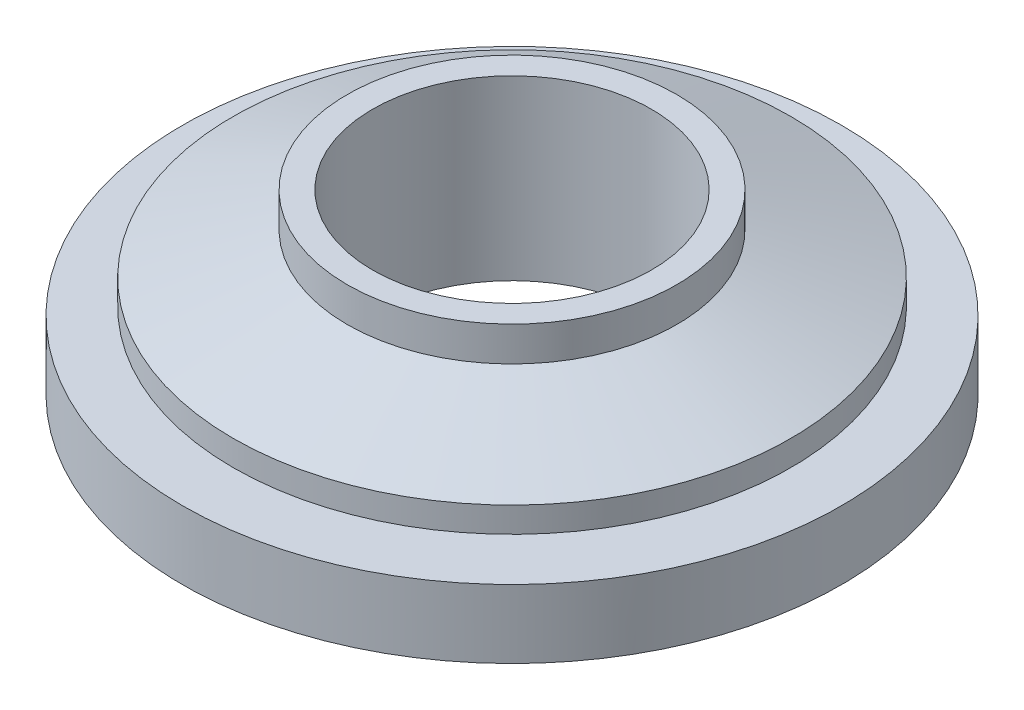
ISO-10303-21;
HEADER;
FILE_DESCRIPTION(('STEP AP214'),'2;1');
FILE_NAME('part.step','',(''),(''),'','','');
FILE_SCHEMA(('AUTOMOTIVE_DESIGN { 1 0 10303 214 1 1 1 1 }'));
ENDSEC;
DATA;
#1=APPLICATION_CONTEXT('core data for automotive mechanical design processes');
#2=APPLICATION_PROTOCOL_DEFINITION('international standard','automotive_design',2000,#1);
#3=PRODUCT_CONTEXT('',#1,'mechanical');
#4=PRODUCT('Part','Part','',(#3));
#5=PRODUCT_RELATED_PRODUCT_CATEGORY('part','',(#4));
#6=PRODUCT_DEFINITION_FORMATION('','',#4);
#7=PRODUCT_DEFINITION_CONTEXT('part definition',#1,'design');
#8=PRODUCT_DEFINITION('design','',#6,#7);
#9=PRODUCT_DEFINITION_SHAPE('','',#8);
#10=(LENGTH_UNIT() NAMED_UNIT(*) SI_UNIT(.MILLI.,.METRE.));
#11=(NAMED_UNIT(*) PLANE_ANGLE_UNIT() SI_UNIT($,.RADIAN.));
#12=(NAMED_UNIT(*) SI_UNIT($,.STERADIAN.) SOLID_ANGLE_UNIT());
#13=UNCERTAINTY_MEASURE_WITH_UNIT(LENGTH_MEASURE(1.E-05),#10,'distance_accuracy_value','');
#14=(GEOMETRIC_REPRESENTATION_CONTEXT(3) GLOBAL_UNCERTAINTY_ASSIGNED_CONTEXT((#13)) GLOBAL_UNIT_ASSIGNED_CONTEXT((#10,
#11,#12)) REPRESENTATION_CONTEXT('',''));
#15=CARTESIAN_POINT('',(0.,0.,0.));
#16=DIRECTION('',(0.,0.,1.));
#17=DIRECTION('',(1.,0.,0.));
#18=AXIS2_PLACEMENT_3D('',#15,#16,#17);
#19=CARTESIAN_POINT('',(0.,39.7695526217005,0.));
#20=DIRECTION('',(0.,-1.,0.));
#21=DIRECTION('',(0.,0.,-1.));
#22=AXIS2_PLACEMENT_3D('',#19,#20,#21);
#23=CYLINDRICAL_SURFACE('',#22,13.);
#24=CARTESIAN_POINT('',(0.,0.,0.));
#25=DIRECTION('',(0.,-1.,0.));
#26=DIRECTION('',(0.,0.,-1.));
#27=AXIS2_PLACEMENT_3D('',#24,#25,#26);
#28=CIRCLE('',#27,13.);
#29=CARTESIAN_POINT('',(0.,0.,-13.));
#30=VERTEX_POINT('',#29);
#31=EDGE_CURVE('E52',#30,#30,#28,.T.);
#32=ORIENTED_EDGE('',*,*,#31,.F.);
#33=EDGE_LOOP('',(#32));
#34=FACE_BOUND('',#33,.T.);
#35=CARTESIAN_POINT('',(0.,2.7,0.));
#36=DIRECTION('',(0.,1.,0.));
#37=DIRECTION('',(0.,0.,1.));
#38=AXIS2_PLACEMENT_3D('',#35,#36,#37);
#39=CIRCLE('',#38,13.);
#40=CARTESIAN_POINT('',(0.,2.7,13.));
#41=VERTEX_POINT('',#40);
#42=EDGE_CURVE('E48',#41,#41,#39,.F.);
#43=ORIENTED_EDGE('',*,*,#42,.T.);
#44=EDGE_LOOP('',(#43));
#45=FACE_BOUND('',#44,.T.);
#46=ADVANCED_FACE('F44',(#34,#45),#23,.T.);
#47=CARTESIAN_POINT('',(0.,39.7695526217005,0.));
#48=DIRECTION('',(0.,-1.,0.));
#49=DIRECTION('',(0.,0.,-1.));
#50=AXIS2_PLACEMENT_3D('',#47,#48,#49);
#51=CYLINDRICAL_SURFACE('',#50,8.6);
#52=CARTESIAN_POINT('',(0.,0.,0.));
#53=DIRECTION('',(0.,-1.,0.));
#54=DIRECTION('',(0.,0.,-1.));
#55=AXIS2_PLACEMENT_3D('',#52,#53,#54);
#56=CIRCLE('',#55,8.6);
#57=CARTESIAN_POINT('',(0.,0.,-8.6));
#58=VERTEX_POINT('',#57);
#59=EDGE_CURVE('E56',#58,#58,#56,.T.);
#60=ORIENTED_EDGE('',*,*,#59,.T.);
#61=EDGE_LOOP('',(#60));
#62=FACE_BOUND('',#61,.T.);
#63=CARTESIAN_POINT('',(0.,2.7,0.));
#64=DIRECTION('',(0.,1.,0.));
#65=DIRECTION('',(0.,0.,1.));
#66=AXIS2_PLACEMENT_3D('',#63,#64,#65);
#67=CIRCLE('',#66,8.6);
#68=CARTESIAN_POINT('',(0.,2.7,8.6));
#69=VERTEX_POINT('',#68);
#70=EDGE_CURVE('E12',#69,#69,#67,.F.);
#71=ORIENTED_EDGE('',*,*,#70,.F.);
#72=EDGE_LOOP('',(#71));
#73=FACE_BOUND('',#72,.T.);
#74=ADVANCED_FACE('F71',(#62,#73),#51,.F.);
#75=CARTESIAN_POINT('',(0.,0.,0.));
#76=DIRECTION('',(0.,-1.,0.));
#77=DIRECTION('',(0.,0.,-1.));
#78=AXIS2_PLACEMENT_3D('',#75,#76,#77);
#79=PLANE('',#78);
#80=ORIENTED_EDGE('',*,*,#59,.F.);
#81=EDGE_LOOP('',(#80));
#82=FACE_BOUND('',#81,.T.);
#83=ORIENTED_EDGE('',*,*,#31,.T.);
#84=EDGE_LOOP('',(#83));
#85=FACE_BOUND('',#84,.T.);
#86=ADVANCED_FACE('F67',(#82,#85),#79,.T.);
#87=CARTESIAN_POINT('',(0.,2.7,0.));
#88=DIRECTION('',(0.,1.,0.));
#89=DIRECTION('',(0.,0.,1.));
#90=AXIS2_PLACEMENT_3D('',#87,#88,#89);
#91=PLANE('',#90);
#92=ORIENTED_EDGE('',*,*,#42,.F.);
#93=EDGE_LOOP('',(#92));
#94=FACE_BOUND('',#93,.T.);
#95=ORIENTED_EDGE('',*,*,#70,.T.);
#96=EDGE_LOOP('',(#95));
#97=FACE_BOUND('',#96,.T.);
#98=ADVANCED_FACE('F46',(#94,#97),#91,.T.);
#99=CLOSED_SHELL('',(#46,#74,#86,#98));
#100=MANIFOLD_SOLID_BREP('B2',#99);
#101=CARTESIAN_POINT('',(0.,7.,0.));
#102=DIRECTION('',(0.,1.,0.));
#103=DIRECTION('',(0.,0.,1.));
#104=AXIS2_PLACEMENT_3D('',#101,#102,#103);
#105=PLANE('',#104);
#106=CARTESIAN_POINT('',(0.,7.,0.));
#107=DIRECTION('',(0.,1.,0.));
#108=DIRECTION('',(0.,0.,1.));
#109=AXIS2_PLACEMENT_3D('',#106,#107,#108);
#110=CIRCLE('',#109,5.5);
#111=CARTESIAN_POINT('',(0.,7.,5.5));
#112=VERTEX_POINT('',#111);
#113=EDGE_CURVE('E135',#112,#112,#110,.T.);
#114=ORIENTED_EDGE('',*,*,#113,.F.);
#115=EDGE_LOOP('',(#114));
#116=FACE_BOUND('',#115,.T.);
#117=CARTESIAN_POINT('',(0.,7.,0.));
#118=DIRECTION('',(0.,1.,0.));
#119=DIRECTION('',(0.,0.,1.));
#120=AXIS2_PLACEMENT_3D('',#117,#118,#119);
#121=CIRCLE('',#120,6.5);
#122=CARTESIAN_POINT('',(0.,7.,6.5));
#123=VERTEX_POINT('',#122);
#124=EDGE_CURVE('E138',#123,#123,#121,.T.);
#125=ORIENTED_EDGE('',*,*,#124,.T.);
#126=EDGE_LOOP('',(#125));
#127=FACE_BOUND('',#126,.T.);
#128=ADVANCED_FACE('F106',(#116,#127),#105,.T.);
#129=CARTESIAN_POINT('',(0.,7.,0.));
#130=DIRECTION('',(0.,-1.,0.));
#131=DIRECTION('',(0.,0.,-1.));
#132=AXIS2_PLACEMENT_3D('',#129,#130,#131);
#133=CYLINDRICAL_SURFACE('',#132,11.);
#134=CARTESIAN_POINT('',(0.,3.99999999999996,0.));
#135=DIRECTION('',(0.,1.,0.));
#136=DIRECTION('',(0.,0.,1.));
#137=AXIS2_PLACEMENT_3D('',#134,#135,#136);
#138=CIRCLE('',#137,11.);
#139=CARTESIAN_POINT('',(0.,3.99999999999996,11.));
#140=VERTEX_POINT('',#139);
#141=EDGE_CURVE('E113',#140,#140,#138,.F.);
#142=ORIENTED_EDGE('',*,*,#141,.T.);
#143=EDGE_LOOP('',(#142));
#144=FACE_BOUND('',#143,.T.);
#145=CARTESIAN_POINT('',(0.,3.,0.));
#146=DIRECTION('',(0.,1.,0.));
#147=DIRECTION('',(0.,0.,1.));
#148=AXIS2_PLACEMENT_3D('',#145,#146,#147);
#149=CIRCLE('',#148,11.);
#150=CARTESIAN_POINT('',(0.,3.,11.));
#151=VERTEX_POINT('',#150);
#152=EDGE_CURVE('E132',#151,#151,#149,.T.);
#153=ORIENTED_EDGE('',*,*,#152,.T.);
#154=EDGE_LOOP('',(#153));
#155=FACE_BOUND('',#154,.T.);
#156=ADVANCED_FACE('F157',(#144,#155),#133,.T.);
#157=CARTESIAN_POINT('',(0.,0.,0.));
#158=DIRECTION('',(0.,1.,0.));
#159=DIRECTION('',(0.,0.,1.));
#160=AXIS2_PLACEMENT_3D('',#157,#158,#159);
#161=PLANE('',#160);
#162=CARTESIAN_POINT('',(0.,0.,0.));
#163=DIRECTION('',(0.,1.,0.));
#164=DIRECTION('',(0.,0.,1.));
#165=AXIS2_PLACEMENT_3D('',#162,#163,#164);
#166=CIRCLE('',#165,6.6);
#167=CARTESIAN_POINT('',(0.,0.,6.6));
#168=VERTEX_POINT('',#167);
#169=EDGE_CURVE('E117',#168,#168,#166,.F.);
#170=ORIENTED_EDGE('',*,*,#169,.T.);
#171=EDGE_LOOP('',(#170));
#172=FACE_BOUND('',#171,.T.);
#173=CARTESIAN_POINT('',(0.,0.,0.));
#174=DIRECTION('',(0.,1.,0.));
#175=DIRECTION('',(0.,0.,1.));
#176=AXIS2_PLACEMENT_3D('',#173,#174,#175);
#177=CIRCLE('',#176,5.5);
#178=CARTESIAN_POINT('',(0.,0.,5.5));
#179=VERTEX_POINT('',#178);
#180=EDGE_CURVE('E129',#179,#179,#177,.T.);
#181=ORIENTED_EDGE('',*,*,#180,.T.);
#182=EDGE_LOOP('',(#181));
#183=FACE_BOUND('',#182,.T.);
#184=ADVANCED_FACE('F162',(#172,#183),#161,.F.);
#185=CARTESIAN_POINT('',(0.,3.,0.));
#186=DIRECTION('',(0.,-1.,0.));
#187=DIRECTION('',(0.,0.,-1.));
#188=AXIS2_PLACEMENT_3D('',#185,#186,#187);
#189=CYLINDRICAL_SURFACE('',#188,7.);
#190=CARTESIAN_POINT('',(0.,1.09899096778184,0.));
#191=DIRECTION('',(0.,1.,0.));
#192=DIRECTION('',(0.,0.,1.));
#193=AXIS2_PLACEMENT_3D('',#190,#191,#192);
#194=CIRCLE('',#193,7.);
#195=CARTESIAN_POINT('',(0.,1.09899096778184,7.));
#196=VERTEX_POINT('',#195);
#197=EDGE_CURVE('E121',#196,#196,#194,.T.);
#198=ORIENTED_EDGE('',*,*,#197,.T.);
#199=EDGE_LOOP('',(#198));
#200=FACE_BOUND('',#199,.T.);
#201=CARTESIAN_POINT('',(0.,3.,0.));
#202=DIRECTION('',(0.,1.,0.));
#203=DIRECTION('',(0.,0.,1.));
#204=AXIS2_PLACEMENT_3D('',#201,#202,#203);
#205=CIRCLE('',#204,7.);
#206=CARTESIAN_POINT('',(0.,3.,7.));
#207=VERTEX_POINT('',#206);
#208=EDGE_CURVE('E126',#207,#207,#205,.T.);
#209=ORIENTED_EDGE('',*,*,#208,.F.);
#210=EDGE_LOOP('',(#209));
#211=FACE_BOUND('',#210,.T.);
#212=ADVANCED_FACE('F169',(#200,#211),#189,.T.);
#213=CARTESIAN_POINT('',(0.,3.,0.));
#214=DIRECTION('',(0.,-1.,0.));
#215=DIRECTION('',(0.,0.,-1.));
#216=AXIS2_PLACEMENT_3D('',#213,#214,#215);
#217=CYLINDRICAL_SURFACE('',#216,5.5);
#218=ORIENTED_EDGE('',*,*,#180,.F.);
#219=EDGE_LOOP('',(#218));
#220=FACE_BOUND('',#219,.T.);
#221=ORIENTED_EDGE('',*,*,#113,.T.);
#222=EDGE_LOOP('',(#221));
#223=FACE_BOUND('',#222,.T.);
#224=ADVANCED_FACE('F166',(#220,#223),#217,.F.);
#225=CARTESIAN_POINT('',(0.,1.09899096778184,0.));
#226=DIRECTION('',(0.,1.,0.));
#227=DIRECTION('',(0.,0.,1.));
#228=AXIS2_PLACEMENT_3D('',#225,#226,#227);
#229=CONICAL_SURFACE('',#228,7.,0.349065850398867);
#230=ORIENTED_EDGE('',*,*,#169,.F.);
#231=EDGE_LOOP('',(#230));
#232=FACE_BOUND('',#231,.T.);
#233=ORIENTED_EDGE('',*,*,#197,.F.);
#234=EDGE_LOOP('',(#233));
#235=FACE_BOUND('',#234,.T.);
#236=ADVANCED_FACE('F152',(#232,#235),#229,.T.);
#237=CARTESIAN_POINT('',(0.,3.,0.));
#238=DIRECTION('',(0.,1.,0.));
#239=DIRECTION('',(0.,0.,1.));
#240=AXIS2_PLACEMENT_3D('',#237,#238,#239);
#241=PLANE('',#240);
#242=ORIENTED_EDGE('',*,*,#152,.F.);
#243=EDGE_LOOP('',(#242));
#244=FACE_BOUND('',#243,.T.);
#245=ORIENTED_EDGE('',*,*,#208,.T.);
#246=EDGE_LOOP('',(#245));
#247=FACE_BOUND('',#246,.T.);
#248=ADVANCED_FACE('F145',(#244,#247),#241,.F.);
#249=CARTESIAN_POINT('',(0.,6.,0.));
#250=DIRECTION('',(0.,1.,0.));
#251=DIRECTION('',(0.,0.,1.));
#252=AXIS2_PLACEMENT_3D('',#249,#250,#251);
#253=CYLINDRICAL_SURFACE('',#252,6.5);
#254=CARTESIAN_POINT('',(0.,5.63786605419785,0.));
#255=DIRECTION('',(0.,-1.,0.));
#256=DIRECTION('',(0.,0.,-1.));
#257=AXIS2_PLACEMENT_3D('',#254,#255,#256);
#258=CIRCLE('',#257,6.5);
#259=CARTESIAN_POINT('',(0.,5.63786605419785,-6.5));
#260=VERTEX_POINT('',#259);
#261=EDGE_CURVE('E43',#260,#260,#258,.F.);
#262=ORIENTED_EDGE('',*,*,#261,.T.);
#263=EDGE_LOOP('',(#262));
#264=FACE_BOUND('',#263,.T.);
#265=ORIENTED_EDGE('',*,*,#124,.F.);
#266=EDGE_LOOP('',(#265));
#267=FACE_BOUND('',#266,.T.);
#268=ADVANCED_FACE('F143',(#264,#267),#253,.T.);
#269=CARTESIAN_POINT('',(0.,6.,0.));
#270=DIRECTION('',(0.,-1.,0.));
#271=DIRECTION('',(0.,0.,-1.));
#272=AXIS2_PLACEMENT_3D('',#269,#270,#271);
#273=CONICAL_SURFACE('',#272,5.50504516109058,1.22173047639603);
#274=ORIENTED_EDGE('',*,*,#141,.F.);
#275=EDGE_LOOP('',(#274));
#276=FACE_BOUND('',#275,.T.);
#277=ORIENTED_EDGE('',*,*,#261,.F.);
#278=EDGE_LOOP('',(#277));
#279=FACE_BOUND('',#278,.T.);
#280=ADVANCED_FACE('F108',(#276,#279),#273,.T.);
#281=CLOSED_SHELL('',(#128,#156,#184,#212,#224,#236,#248,#268,#280));
#282=MANIFOLD_SOLID_BREP('B7',#281);
#283=ADVANCED_BREP_SHAPE_REPRESENTATION('',(#18,#100,#282),#14);
#284=SHAPE_DEFINITION_REPRESENTATION(#9,#283);
ENDSEC;
END-ISO-10303-21;
